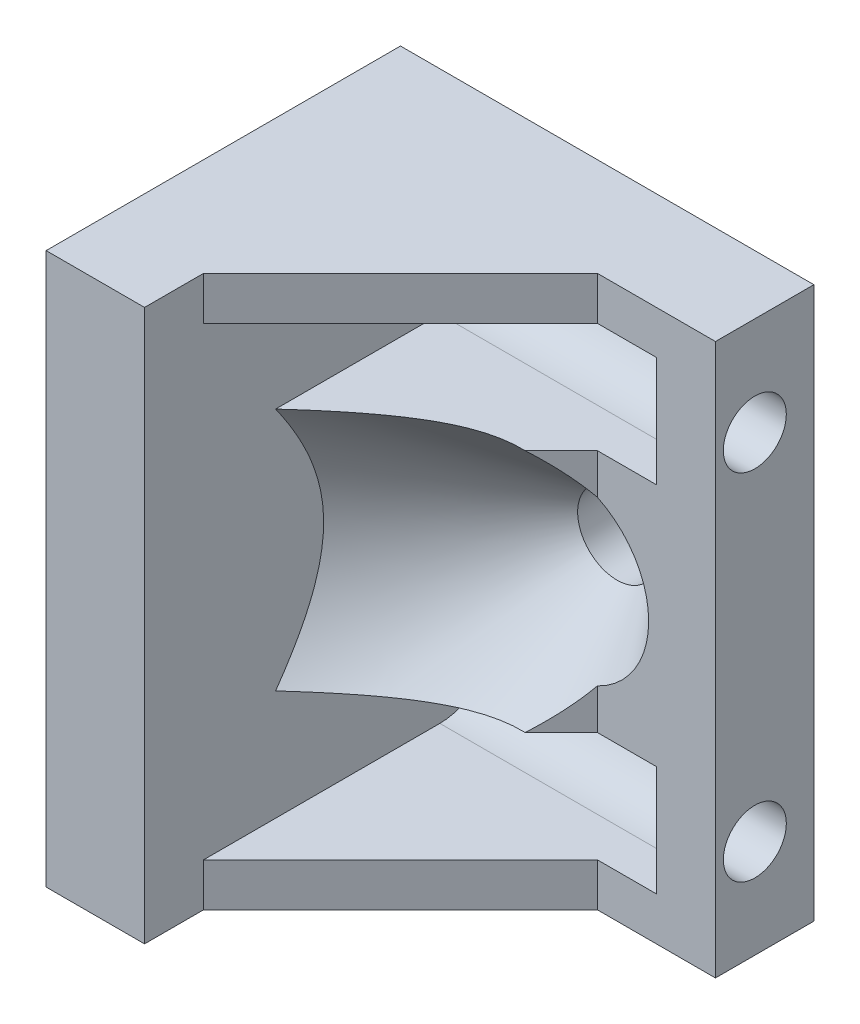
ISO-10303-21;
HEADER;
FILE_DESCRIPTION(('STEP AP214'),'2;1');
FILE_NAME('part.step','',(''),(''),'','','');
FILE_SCHEMA(('AUTOMOTIVE_DESIGN { 1 0 10303 214 1 1 1 1 }'));
ENDSEC;
DATA;
#1=APPLICATION_CONTEXT('core data for automotive mechanical design processes');
#2=APPLICATION_PROTOCOL_DEFINITION('international standard','automotive_design',2000,#1);
#3=PRODUCT_CONTEXT('',#1,'mechanical');
#4=PRODUCT('Part','Part','',(#3));
#5=PRODUCT_RELATED_PRODUCT_CATEGORY('part','',(#4));
#6=PRODUCT_DEFINITION_FORMATION('','',#4);
#7=PRODUCT_DEFINITION_CONTEXT('part definition',#1,'design');
#8=PRODUCT_DEFINITION('design','',#6,#7);
#9=PRODUCT_DEFINITION_SHAPE('','',#8);
#10=(LENGTH_UNIT() NAMED_UNIT(*) SI_UNIT(.MILLI.,.METRE.));
#11=(NAMED_UNIT(*) PLANE_ANGLE_UNIT() SI_UNIT($,.RADIAN.));
#12=(NAMED_UNIT(*) SI_UNIT($,.STERADIAN.) SOLID_ANGLE_UNIT());
#13=UNCERTAINTY_MEASURE_WITH_UNIT(LENGTH_MEASURE(1.E-05),#10,'distance_accuracy_value','');
#14=(GEOMETRIC_REPRESENTATION_CONTEXT(3) GLOBAL_UNCERTAINTY_ASSIGNED_CONTEXT((#13)) GLOBAL_UNIT_ASSIGNED_CONTEXT((#10,
#11,#12)) REPRESENTATION_CONTEXT('',''));
#15=CARTESIAN_POINT('',(0.,0.,0.));
#16=DIRECTION('',(0.,0.,1.));
#17=DIRECTION('',(1.,0.,0.));
#18=AXIS2_PLACEMENT_3D('',#15,#16,#17);
#19=CARTESIAN_POINT('',(2.00000000000018,0.,5.));
#20=DIRECTION('',(-0.707106781186544,0.,-0.707106781186551));
#21=DIRECTION('',(0.,-1.,0.));
#22=AXIS2_PLACEMENT_3D('',#19,#20,#21);
#23=PLANE('',#22);
#24=DIRECTION('',(0.707106781186551,0.,-0.707106781186544));
#25=VECTOR('',#24,1.);
#26=CARTESIAN_POINT('',(6.0000000000001,6.2,1.00000000000012));
#27=LINE('',#26,#25);
#28=CARTESIAN_POINT('',(0.165899815839284,6.2,6.83410018416088));
#29=VERTEX_POINT('',#28);
#30=CARTESIAN_POINT('',(2.00000000000018,6.2,5.));
#31=VERTEX_POINT('',#30);
#32=EDGE_CURVE('E335',#29,#31,#27,.T.);
#33=ORIENTED_EDGE('',*,*,#32,.F.);
#34=CARTESIAN_POINT('',(-22.5786110582015,0.,29.5786110582014));
#35=DIRECTION('',(-0.707106781186544,0.,-0.707106781186551));
#36=DIRECTION('',(-0.707106781186551,0.,0.707106781186544));
#37=AXIS2_PLACEMENT_3D('',#34,#35,#36);
#38=ELLIPSE('',#37,36.7323882776254,12.8390224305274);
#39=CARTESIAN_POINT('',(2.00000000000018,4.15118967847563,5.));
#40=VERTEX_POINT('',#39);
#41=EDGE_CURVE('E329',#40,#29,#38,.F.);
#42=ORIENTED_EDGE('',*,*,#41,.F.);
#43=DIRECTION('',(0.,-1.,0.));
#44=VECTOR('',#43,1.);
#45=CARTESIAN_POINT('',(2.00000000000018,0.,5.));
#46=LINE('',#45,#44);
#47=EDGE_CURVE('E306',#31,#40,#46,.T.);
#48=ORIENTED_EDGE('',*,*,#47,.F.);
#49=EDGE_LOOP('',(#33,#42,#48));
#50=FACE_BOUND('',#49,.T.);
#51=ADVANCED_FACE('F39',(#50),#23,.F.);
#52=CARTESIAN_POINT('',(0.,0.,5.));
#53=DIRECTION('',(0.,0.,1.));
#54=DIRECTION('',(1.,0.,0.));
#55=AXIS2_PLACEMENT_3D('',#52,#53,#54);
#56=PLANE('',#55);
#57=DIRECTION('',(-1.,0.,0.));
#58=VECTOR('',#57,1.);
#59=CARTESIAN_POINT('',(-8.,14.,5.));
#60=LINE('',#59,#58);
#61=CARTESIAN_POINT('',(8.,14.,5.));
#62=VERTEX_POINT('',#61);
#63=CARTESIAN_POINT('',(2.00000000000007,14.,5.));
#64=VERTEX_POINT('',#63);
#65=EDGE_CURVE('E267',#62,#64,#60,.T.);
#66=ORIENTED_EDGE('',*,*,#65,.T.);
#67=DIRECTION('',(0.,-1.,0.));
#68=VECTOR('',#67,1.);
#69=CARTESIAN_POINT('',(2.00000000000007,0.,5.));
#70=LINE('',#69,#68);
#71=CARTESIAN_POINT('',(2.00000000000007,11.8,5.));
#72=VERTEX_POINT('',#71);
#73=EDGE_CURVE('E312',#64,#72,#70,.T.);
#74=ORIENTED_EDGE('',*,*,#73,.T.);
#75=DIRECTION('',(-1.,0.,0.));
#76=VECTOR('',#75,1.);
#77=CARTESIAN_POINT('',(0.,11.8,5.));
#78=LINE('',#77,#76);
#79=CARTESIAN_POINT('',(5.,11.8,5.));
#80=VERTEX_POINT('',#79);
#81=EDGE_CURVE('E230',#80,#72,#78,.T.);
#82=ORIENTED_EDGE('',*,*,#81,.F.);
#83=DIRECTION('',(0.,-1.,0.));
#84=VECTOR('',#83,1.);
#85=CARTESIAN_POINT('',(5.,0.,5.));
#86=LINE('',#85,#84);
#87=CARTESIAN_POINT('',(5.,6.2,5.));
#88=VERTEX_POINT('',#87);
#89=EDGE_CURVE('E290',#80,#88,#86,.T.);
#90=ORIENTED_EDGE('',*,*,#89,.T.);
#91=DIRECTION('',(1.,0.,0.));
#92=VECTOR('',#91,1.);
#93=CARTESIAN_POINT('',(0.,6.2,5.));
#94=LINE('',#93,#92);
#95=EDGE_CURVE('E206',#31,#88,#94,.T.);
#96=ORIENTED_EDGE('',*,*,#95,.F.);
#97=ORIENTED_EDGE('',*,*,#47,.T.);
#98=CARTESIAN_POINT('',(0.,0.,5.));
#99=DIRECTION('',(0.,0.,1.));
#100=DIRECTION('',(1.,0.,0.));
#101=AXIS2_PLACEMENT_3D('',#98,#99,#100);
#102=CIRCLE('',#101,4.60786021344868);
#103=CARTESIAN_POINT('',(2.00000000000018,-4.15118967847563,5.));
#104=VERTEX_POINT('',#103);
#105=EDGE_CURVE('E287',#40,#104,#102,.F.);
#106=ORIENTED_EDGE('',*,*,#105,.T.);
#107=DIRECTION('',(0.,-1.,0.));
#108=VECTOR('',#107,1.);
#109=CARTESIAN_POINT('',(2.00000000000018,0.,5.));
#110=LINE('',#109,#108);
#111=CARTESIAN_POINT('',(2.00000000000018,-6.2,5.));
#112=VERTEX_POINT('',#111);
#113=EDGE_CURVE('E295',#104,#112,#110,.T.);
#114=ORIENTED_EDGE('',*,*,#113,.T.);
#115=DIRECTION('',(-1.,0.,0.));
#116=VECTOR('',#115,1.);
#117=CARTESIAN_POINT('',(0.,-6.2,5.));
#118=LINE('',#117,#116);
#119=CARTESIAN_POINT('',(5.,-6.2,5.));
#120=VERTEX_POINT('',#119);
#121=EDGE_CURVE('E234',#120,#112,#118,.T.);
#122=ORIENTED_EDGE('',*,*,#121,.F.);
#123=DIRECTION('',(0.,-1.,0.));
#124=VECTOR('',#123,1.);
#125=CARTESIAN_POINT('',(5.,0.,5.));
#126=LINE('',#125,#124);
#127=CARTESIAN_POINT('',(5.,-11.8,5.));
#128=VERTEX_POINT('',#127);
#129=EDGE_CURVE('E293',#120,#128,#126,.T.);
#130=ORIENTED_EDGE('',*,*,#129,.T.);
#131=DIRECTION('',(1.,0.,0.));
#132=VECTOR('',#131,1.);
#133=CARTESIAN_POINT('',(0.,-11.8,5.));
#134=LINE('',#133,#132);
#135=CARTESIAN_POINT('',(2.00000000000007,-11.8,5.));
#136=VERTEX_POINT('',#135);
#137=EDGE_CURVE('E196',#136,#128,#134,.T.);
#138=ORIENTED_EDGE('',*,*,#137,.F.);
#139=DIRECTION('',(0.,-1.,0.));
#140=VECTOR('',#139,1.);
#141=CARTESIAN_POINT('',(2.00000000000007,0.,5.));
#142=LINE('',#141,#140);
#143=CARTESIAN_POINT('',(2.00000000000007,-14.,5.));
#144=VERTEX_POINT('',#143);
#145=EDGE_CURVE('E309',#136,#144,#142,.T.);
#146=ORIENTED_EDGE('',*,*,#145,.T.);
#147=DIRECTION('',(1.,0.,0.));
#148=VECTOR('',#147,1.);
#149=CARTESIAN_POINT('',(-8.,-14.,5.));
#150=LINE('',#149,#148);
#151=CARTESIAN_POINT('',(8.,-14.,5.));
#152=VERTEX_POINT('',#151);
#153=EDGE_CURVE('E271',#144,#152,#150,.T.);
#154=ORIENTED_EDGE('',*,*,#153,.T.);
#155=DIRECTION('',(0.,1.,0.));
#156=VECTOR('',#155,1.);
#157=CARTESIAN_POINT('',(8.,14.,5.));
#158=LINE('',#157,#156);
#159=EDGE_CURVE('E264',#152,#62,#158,.T.);
#160=ORIENTED_EDGE('',*,*,#159,.T.);
#161=EDGE_LOOP('',(#66,#74,#82,#90,#96,#97,#106,#114,#122,#130,#138,#146,#154,#160));
#162=FACE_BOUND('',#161,.T.);
#163=ADVANCED_FACE('F384',(#162),#56,.T.);
#164=CARTESIAN_POINT('',(0.,0.,0.));
#165=DIRECTION('',(0.,0.,1.));
#166=DIRECTION('',(1.,0.,0.));
#167=AXIS2_PLACEMENT_3D('',#164,#165,#166);
#168=PLANE('',#167);
#169=DIRECTION('',(0.,1.,0.));
#170=VECTOR('',#169,1.);
#171=CARTESIAN_POINT('',(8.,14.,0.));
#172=LINE('',#171,#170);
#173=CARTESIAN_POINT('',(8.,-14.,0.));
#174=VERTEX_POINT('',#173);
#175=CARTESIAN_POINT('',(8.,14.,0.));
#176=VERTEX_POINT('',#175);
#177=EDGE_CURVE('E263',#174,#176,#172,.T.);
#178=ORIENTED_EDGE('',*,*,#177,.F.);
#179=DIRECTION('',(1.,0.,0.));
#180=VECTOR('',#179,1.);
#181=CARTESIAN_POINT('',(-8.,-14.,0.));
#182=LINE('',#181,#180);
#183=CARTESIAN_POINT('',(-13.,-14.,0.));
#184=VERTEX_POINT('',#183);
#185=EDGE_CURVE('E268',#184,#174,#182,.T.);
#186=ORIENTED_EDGE('',*,*,#185,.F.);
#187=DIRECTION('',(0.,-1.,0.));
#188=VECTOR('',#187,1.);
#189=CARTESIAN_POINT('',(-13.,14.,0.));
#190=LINE('',#189,#188);
#191=CARTESIAN_POINT('',(-13.,14.,0.));
#192=VERTEX_POINT('',#191);
#193=EDGE_CURVE('E241',#192,#184,#190,.T.);
#194=ORIENTED_EDGE('',*,*,#193,.F.);
#195=DIRECTION('',(-1.,0.,0.));
#196=VECTOR('',#195,1.);
#197=CARTESIAN_POINT('',(-8.,14.,0.));
#198=LINE('',#197,#196);
#199=EDGE_CURVE('E276',#176,#192,#198,.T.);
#200=ORIENTED_EDGE('',*,*,#199,.F.);
#201=EDGE_LOOP('',(#178,#186,#194,#200));
#202=FACE_BOUND('',#201,.T.);
#203=CARTESIAN_POINT('',(0.,0.,0.));
#204=DIRECTION('',(0.,0.,1.));
#205=DIRECTION('',(1.,0.,0.));
#206=AXIS2_PLACEMENT_3D('',#203,#204,#205);
#207=CIRCLE('',#206,2.);
#208=CARTESIAN_POINT('',(2.00000000000001,0.,0.));
#209=VERTEX_POINT('',#208);
#210=EDGE_CURVE('E260',#209,#209,#207,.T.);
#211=ORIENTED_EDGE('',*,*,#210,.T.);
#212=EDGE_LOOP('',(#211));
#213=FACE_BOUND('',#212,.T.);
#214=ADVANCED_FACE('F389',(#202,#213),#168,.F.);
#215=CARTESIAN_POINT('',(8.,14.,5.));
#216=DIRECTION('',(-1.,0.,0.));
#217=DIRECTION('',(0.,-1.,0.));
#218=AXIS2_PLACEMENT_3D('',#215,#216,#217);
#219=PLANE('',#218);
#220=CARTESIAN_POINT('',(8.,-9.00000000000001,3.));
#221=DIRECTION('',(1.,0.,0.));
#222=DIRECTION('',(0.,0.,-1.));
#223=AXIS2_PLACEMENT_3D('',#220,#221,#222);
#224=CIRCLE('',#223,1.6);
#225=CARTESIAN_POINT('',(8.,-9.00000000000001,1.4));
#226=VERTEX_POINT('',#225);
#227=EDGE_CURVE('E740',#226,#226,#224,.T.);
#228=ORIENTED_EDGE('',*,*,#227,.F.);
#229=EDGE_LOOP('',(#228));
#230=FACE_BOUND('',#229,.T.);
#231=CARTESIAN_POINT('',(8.,9.,3.));
#232=DIRECTION('',(1.,0.,0.));
#233=DIRECTION('',(0.,0.,-1.));
#234=AXIS2_PLACEMENT_3D('',#231,#232,#233);
#235=CIRCLE('',#234,1.6);
#236=CARTESIAN_POINT('',(8.,9.,1.4));
#237=VERTEX_POINT('',#236);
#238=EDGE_CURVE('E737',#237,#237,#235,.T.);
#239=ORIENTED_EDGE('',*,*,#238,.F.);
#240=EDGE_LOOP('',(#239));
#241=FACE_BOUND('',#240,.T.);
#242=ORIENTED_EDGE('',*,*,#177,.T.);
#243=DIRECTION('',(0.,0.,-1.));
#244=VECTOR('',#243,1.);
#245=CARTESIAN_POINT('',(8.,14.,5.));
#246=LINE('',#245,#244);
#247=EDGE_CURVE('E281',#62,#176,#246,.T.);
#248=ORIENTED_EDGE('',*,*,#247,.F.);
#249=ORIENTED_EDGE('',*,*,#159,.F.);
#250=DIRECTION('',(0.,0.,-1.));
#251=VECTOR('',#250,1.);
#252=CARTESIAN_POINT('',(8.,-14.,5.));
#253=LINE('',#252,#251);
#254=EDGE_CURVE('E273',#152,#174,#253,.T.);
#255=ORIENTED_EDGE('',*,*,#254,.T.);
#256=EDGE_LOOP('',(#242,#248,#249,#255));
#257=FACE_BOUND('',#256,.T.);
#258=ADVANCED_FACE('F423',(#230,#241,#257),#219,.F.);
#259=CARTESIAN_POINT('',(-8.,14.,5.));
#260=DIRECTION('',(0.,-1.,0.));
#261=DIRECTION('',(0.,0.,-1.));
#262=AXIS2_PLACEMENT_3D('',#259,#260,#261);
#263=PLANE('',#262);
#264=ORIENTED_EDGE('',*,*,#199,.T.);
#265=DIRECTION('',(0.,0.,-1.));
#266=VECTOR('',#265,1.);
#267=CARTESIAN_POINT('',(-13.,14.,18.));
#268=LINE('',#267,#266);
#269=CARTESIAN_POINT('',(-13.,14.,18.));
#270=VERTEX_POINT('',#269);
#271=EDGE_CURVE('E238',#270,#192,#268,.T.);
#272=ORIENTED_EDGE('',*,*,#271,.F.);
#273=DIRECTION('',(1.,0.,0.));
#274=VECTOR('',#273,1.);
#275=CARTESIAN_POINT('',(-13.,14.,18.));
#276=LINE('',#275,#274);
#277=CARTESIAN_POINT('',(-8.,14.,18.));
#278=VERTEX_POINT('',#277);
#279=EDGE_CURVE('E249',#270,#278,#276,.T.);
#280=ORIENTED_EDGE('',*,*,#279,.T.);
#281=DIRECTION('',(0.,0.,-1.));
#282=VECTOR('',#281,1.);
#283=CARTESIAN_POINT('',(-8.,14.,18.));
#284=LINE('',#283,#282);
#285=CARTESIAN_POINT('',(-8.,14.,15.));
#286=VERTEX_POINT('',#285);
#287=EDGE_CURVE('E237',#278,#286,#284,.T.);
#288=ORIENTED_EDGE('',*,*,#287,.T.);
#289=DIRECTION('',(0.707106781186551,0.,-0.707106781186544));
#290=VECTOR('',#289,1.);
#291=CARTESIAN_POINT('',(-3.00000000000002,14.,10.));
#292=LINE('',#291,#290);
#293=EDGE_CURVE('E323',#286,#64,#292,.T.);
#294=ORIENTED_EDGE('',*,*,#293,.T.);
#295=ORIENTED_EDGE('',*,*,#65,.F.);
#296=ORIENTED_EDGE('',*,*,#247,.T.);
#297=EDGE_LOOP('',(#264,#272,#280,#288,#294,#295,#296));
#298=FACE_BOUND('',#297,.T.);
#299=ADVANCED_FACE('F417',(#298),#263,.F.);
#300=CARTESIAN_POINT('',(-8.,-14.,5.));
#301=DIRECTION('',(0.,1.,0.));
#302=DIRECTION('',(0.,0.,1.));
#303=AXIS2_PLACEMENT_3D('',#300,#301,#302);
#304=PLANE('',#303);
#305=ORIENTED_EDGE('',*,*,#185,.T.);
#306=ORIENTED_EDGE('',*,*,#254,.F.);
#307=ORIENTED_EDGE('',*,*,#153,.F.);
#308=DIRECTION('',(-0.707106781186551,0.,0.707106781186544));
#309=VECTOR('',#308,1.);
#310=CARTESIAN_POINT('',(-3.00000000000002,-14.,10.));
#311=LINE('',#310,#309);
#312=CARTESIAN_POINT('',(-8.,-14.,15.));
#313=VERTEX_POINT('',#312);
#314=EDGE_CURVE('E325',#144,#313,#311,.T.);
#315=ORIENTED_EDGE('',*,*,#314,.T.);
#316=DIRECTION('',(0.,0.,1.));
#317=VECTOR('',#316,1.);
#318=CARTESIAN_POINT('',(-8.,-14.,0.));
#319=LINE('',#318,#317);
#320=CARTESIAN_POINT('',(-8.,-14.,18.));
#321=VERTEX_POINT('',#320);
#322=EDGE_CURVE('E252',#313,#321,#319,.T.);
#323=ORIENTED_EDGE('',*,*,#322,.T.);
#324=DIRECTION('',(1.,0.,0.));
#325=VECTOR('',#324,1.);
#326=CARTESIAN_POINT('',(-13.,-14.,18.));
#327=LINE('',#326,#325);
#328=CARTESIAN_POINT('',(-13.,-14.,18.));
#329=VERTEX_POINT('',#328);
#330=EDGE_CURVE('E257',#329,#321,#327,.T.);
#331=ORIENTED_EDGE('',*,*,#330,.F.);
#332=DIRECTION('',(0.,0.,1.));
#333=VECTOR('',#332,1.);
#334=CARTESIAN_POINT('',(-13.,-14.,0.));
#335=LINE('',#334,#333);
#336=EDGE_CURVE('E245',#184,#329,#335,.T.);
#337=ORIENTED_EDGE('',*,*,#336,.F.);
#338=EDGE_LOOP('',(#305,#306,#307,#315,#323,#331,#337));
#339=FACE_BOUND('',#338,.T.);
#340=ADVANCED_FACE('F455',(#339),#304,.F.);
#341=CARTESIAN_POINT('',(0.,0.,5.));
#342=DIRECTION('',(0.,0.,-1.));
#343=DIRECTION('',(-1.,0.,0.));
#344=AXIS2_PLACEMENT_3D('',#341,#342,#343);
#345=CYLINDRICAL_SURFACE('',#344,2.);
#346=CARTESIAN_POINT('',(0.,0.,1.99999999999999));
#347=DIRECTION('',(0.,0.,1.));
#348=DIRECTION('',(1.,0.,0.));
#349=AXIS2_PLACEMENT_3D('',#346,#347,#348);
#350=CIRCLE('',#349,2.);
#351=CARTESIAN_POINT('',(2.00000000000001,0.,1.99999999999999));
#352=VERTEX_POINT('',#351);
#353=EDGE_CURVE('E284',#352,#352,#350,.T.);
#354=ORIENTED_EDGE('',*,*,#353,.T.);
#355=EDGE_LOOP('',(#354));
#356=FACE_BOUND('',#355,.T.);
#357=ORIENTED_EDGE('',*,*,#210,.F.);
#358=EDGE_LOOP('',(#357));
#359=FACE_BOUND('',#358,.T.);
#360=ADVANCED_FACE('F450',(#356,#359),#345,.F.);
#361=CARTESIAN_POINT('',(0.,0.,1.99999999999999));
#362=DIRECTION('',(0.,0.,1.));
#363=DIRECTION('',(1.,0.,0.));
#364=AXIS2_PLACEMENT_3D('',#361,#362,#363);
#365=CONICAL_SURFACE('',#364,2.,0.715584993317673);
#366=ORIENTED_EDGE('',*,*,#41,.T.);
#367=CARTESIAN_POINT('',(0.165899815839287,6.2,6.83410018416086));
#368=CARTESIAN_POINT('',(0.0854524939375996,6.2,6.83161960370844));
#369=CARTESIAN_POINT('',(0.0049599534235158,6.2,6.83094810748919));
#370=CARTESIAN_POINT('',(-0.155967024119369,6.2,6.83320421606785));
#371=CARTESIAN_POINT('',(-0.236401466008453,6.2,6.83613147331665));
#372=CARTESIAN_POINT('',(-0.477108803069809,6.2,6.85026442107147));
#373=CARTESIAN_POINT('',(-0.637096589428157,6.2,6.8668119089187));
#374=CARTESIAN_POINT('',(-0.951745062722529,6.2,6.9129027617409));
#375=CARTESIAN_POINT('',(-1.1064473732912,6.2,6.94216903662653));
#376=CARTESIAN_POINT('',(-1.41320836684496,6.2,7.012435004904));
#377=CARTESIAN_POINT('',(-1.56526576052291,6.2,7.05344025952656));
#378=CARTESIAN_POINT('',(-1.95375799605865,6.2,7.17263473399135));
#379=CARTESIAN_POINT('',(-2.18781530629995,6.2,7.25857786607615));
#380=CARTESIAN_POINT('',(-2.64748062600462,6.2,7.45065997838161));
#381=CARTESIAN_POINT('',(-2.87308273052245,6.2,7.556812769256));
#382=CARTESIAN_POINT('',(-3.20813366975678,6.2,7.728954017379));
#383=CARTESIAN_POINT('',(-3.32055521053778,6.2,7.78927259264489));
#384=CARTESIAN_POINT('',(-3.54343572992499,6.2,7.91344317729272));
#385=CARTESIAN_POINT('',(-3.65389467657027,6.2,7.97729524414819));
#386=CARTESIAN_POINT('',(-3.87292665175177,6.2,8.10803920139321));
#387=CARTESIAN_POINT('',(-3.98150047841874,6.2,8.17492975969793));
#388=CARTESIAN_POINT('',(-4.19694252796061,6.2,8.3113863191842));
#389=CARTESIAN_POINT('',(-4.30381082178165,6.2,8.38095220866568));
#390=CARTESIAN_POINT('',(-4.6469764425234,6.2,8.6097538324039));
#391=CARTESIAN_POINT('',(-4.88016821467337,6.2,8.77365737051017));
#392=CARTESIAN_POINT('',(-5.34016608000864,6.2,9.11022742411434));
#393=CARTESIAN_POINT('',(-5.5669704815534,6.2,9.28289622770847));
#394=CARTESIAN_POINT('',(-6.01550059445731,6.2,9.63510203045283));
#395=CARTESIAN_POINT('',(-6.23722145199067,6.2,9.81464518963651));
#396=CARTESIAN_POINT('',(-6.67627489866721,6.2,10.1789582288703));
#397=CARTESIAN_POINT('',(-6.89360788836301,6.2,10.3637276281048));
#398=CARTESIAN_POINT('',(-7.3255666773944,6.2,10.738227432071));
#399=CARTESIAN_POINT('',(-7.54017706397409,6.2,10.9279755699905));
#400=CARTESIAN_POINT('',(-7.96635006586118,6.2,11.3108651911766));
#401=CARTESIAN_POINT('',(-8.17791262231926,6.2,11.5040067398057));
#402=CARTESIAN_POINT('',(-8.59836154332632,6.2,11.8929630409263));
#403=CARTESIAN_POINT('',(-8.80724921938908,6.2,12.0887763778839));
#404=CARTESIAN_POINT('',(-9.22284734602362,6.2,12.4827018020615));
#405=CARTESIAN_POINT('',(-9.42955776958751,6.2,12.6808139177329));
#406=CARTESIAN_POINT('',(-9.9914966403294,6.2,13.2244231959267));
#407=CARTESIAN_POINT('',(-10.3448744972848,6.2,13.5718331315365));
#408=CARTESIAN_POINT('',(-11.0473744196717,6.2,14.2710104152204));
#409=CARTESIAN_POINT('',(-11.3964959055096,6.2,14.6227783438626));
#410=CARTESIAN_POINT('',(-12.0883599349184,6.2,15.3266060450092));
#411=CARTESIAN_POINT('',(-12.4311315147704,6.2,15.6786373178688));
#412=CARTESIAN_POINT('',(-13.1138960269817,6.2,16.3852564200627));
#413=CARTESIAN_POINT('',(-13.45388947518,6.2,16.7398437506686));
#414=CARTESIAN_POINT('',(-13.7928367636548,6.2,17.0954180633267));
#415=B_SPLINE_CURVE_WITH_KNOTS('',3,(#367,#368,#369,#370,#371,#372,#373,#374,#375,#376,#377,
#378,#379,#380,#381,#382,#383,#384,#385,#386,#387,#388,#389,#390,#391,#392,#393,#394,#395,#396,
#397,#398,#399,#400,#401,#402,#403,#404,#405,#406,#407,#408,#409,#410,#411,#412,#413,#414),
.UNSPECIFIED.,.F.,.F.,(4,2,2,2,2,2,2,2,2,2,2,2,2,2,2,2,2,2,2,2,2,2,2,4),(0.,0.241415720809553,
0.482808128760809,0.964663269062492,1.43650931840259,1.90857927130692,2.65529052160058,
3.40251389480891,3.78520504900688,4.1679024296474,4.55043362386823,4.93294886399936,
5.7877345300673,6.64274448956265,7.4985394189486,8.35425586941339,9.2136056607899,
10.0729720228224,10.9318995200261,11.7908376593425,13.2774319088057,14.7642263774724,
16.2382407373458,17.7119748842424),.UNSPECIFIED.);
#416=CARTESIAN_POINT('',(-8.,6.2,11.3424463871447));
#417=VERTEX_POINT('',#416);
#418=EDGE_CURVE('E337',#29,#417,#415,.T.);
#419=ORIENTED_EDGE('',*,*,#418,.T.);
#420=CARTESIAN_POINT('',(-8.,6.2,11.3424463871447));
#421=CARTESIAN_POINT('',(-8.,6.06446138209479,11.246946626476));
#422=CARTESIAN_POINT('',(-8.,5.92800529387916,11.1527335120147));
#423=CARTESIAN_POINT('',(-8.,5.65305399520833,10.9672706326851));
#424=CARTESIAN_POINT('',(-8.,5.51455836097035,10.8760214966767));
#425=CARTESIAN_POINT('',(-8.,5.23484913992488,10.6965761675482));
#426=CARTESIAN_POINT('',(-8.,5.09362721039085,10.6083929256361));
#427=CARTESIAN_POINT('',(-8.,4.80881265785979,10.4359685336822));
#428=CARTESIAN_POINT('',(-8.,4.66522016479935,10.3517271685402));
#429=CARTESIAN_POINT('',(-8.,4.22301559258754,10.1014626473688));
#430=CARTESIAN_POINT('',(-8.,3.92025050214922,9.94264387379291));
#431=CARTESIAN_POINT('',(-8.,3.30296719247313,9.65049661922187));
#432=CARTESIAN_POINT('',(-8.,2.98846768005339,9.51712947872468));
#433=CARTESIAN_POINT('',(-8.,2.46634231722398,9.32712026147012));
#434=CARTESIAN_POINT('',(-8.,2.26239661375858,9.26037740767117));
#435=CARTESIAN_POINT('',(-8.,1.850028195375,9.14229207494978));
#436=CARTESIAN_POINT('',(-8.,1.64160537564422,9.09094995699195));
#437=CARTESIAN_POINT('',(-8.,1.22312439260939,9.00616545355613));
#438=CARTESIAN_POINT('',(-8.,1.01309941114457,8.97256120520363));
#439=CARTESIAN_POINT('',(-8.,0.590881258573948,8.92411643567965));
#440=CARTESIAN_POINT('',(-8.,0.378688254291319,8.90927448160248));
#441=CARTESIAN_POINT('',(-8.,-0.0477178954834537,8.89908380724976));
#442=CARTESIAN_POINT('',(-8.,-0.261934511570398,8.90387760232381));
#443=CARTESIAN_POINT('',(-8.,-0.689016862688569,8.93302362408575));
#444=CARTESIAN_POINT('',(-8.,-0.901882563718296,8.95737634110443));
#445=CARTESIAN_POINT('',(-8.,-1.32545085569344,9.0245323224012));
#446=CARTESIAN_POINT('',(-8.,-1.53614257722871,9.06740328442943));
#447=CARTESIAN_POINT('',(-8.,-1.9534465091492,9.16969155859051));
#448=CARTESIAN_POINT('',(-8.,-2.16005799527765,9.22911178050398));
#449=CARTESIAN_POINT('',(-8.,-2.68413726906162,9.39998035807564));
#450=CARTESIAN_POINT('',(-8.,-2.99820593897757,9.52184663600911));
#451=CARTESIAN_POINT('',(-8.,-3.61446677412625,9.79259172045146));
#452=CARTESIAN_POINT('',(-8.,-3.91664987812359,9.94149066824817));
#453=CARTESIAN_POINT('',(-8.,-4.36319397344508,10.180877383728));
#454=CARTESIAN_POINT('',(-8.,-4.51167970714308,10.2638231941074));
#455=CARTESIAN_POINT('',(-8.,-4.80604361167052,10.434232230757));
#456=CARTESIAN_POINT('',(-8.,-4.95192174668071,10.5216955190174));
#457=CARTESIAN_POINT('',(-8.,-5.24118676236601,10.7004887055818));
#458=CARTESIAN_POINT('',(-8.,-5.38457476298525,10.79181679864));
#459=CARTESIAN_POINT('',(-8.,-5.66911378536614,10.9778713852568));
#460=CARTESIAN_POINT('',(-8.,-5.81026490426118,11.0725977306651));
#461=CARTESIAN_POINT('',(-8.,-6.27815944447799,11.3938161905561));
#462=CARTESIAN_POINT('',(-8.,-6.60036936113751,11.6269255889341));
#463=CARTESIAN_POINT('',(-8.,-7.23582956221234,12.1050987477211));
#464=CARTESIAN_POINT('',(-8.,-7.54907741940416,12.3501656989123));
#465=CARTESIAN_POINT('',(-8.,-8.16855379418064,12.8495605381491));
#466=CARTESIAN_POINT('',(-8.,-8.47477556697284,13.1038967641899));
#467=CARTESIAN_POINT('',(-8.,-9.08122722680408,13.6195295552125));
#468=CARTESIAN_POINT('',(-8.,-9.38145768405376,13.8808254522429));
#469=CARTESIAN_POINT('',(-8.,-9.97827391503686,14.4100275178979));
#470=CARTESIAN_POINT('',(-8.,-10.2748391468716,14.6779567960791));
#471=CARTESIAN_POINT('',(-8.,-10.8638912909483,15.21826420358));
#472=CARTESIAN_POINT('',(-8.,-11.1563781208783,15.49064242245));
#473=CARTESIAN_POINT('',(-8.,-11.7377900934136,16.0388687655915));
#474=CARTESIAN_POINT('',(-8.,-12.026717003806,16.3147150178533));
#475=CARTESIAN_POINT('',(-8.,-12.6016989769424,16.8693867557408));
#476=CARTESIAN_POINT('',(-8.,-12.8877540071786,17.1482122750165));
#477=CARTESIAN_POINT('',(-8.,-13.6811885139944,17.9283371007481));
#478=CARTESIAN_POINT('',(-8.,-14.1859084953586,18.4323410027064));
#479=CARTESIAN_POINT('',(-8.,-15.1895229649515,19.446240270251));
#480=CARTESIAN_POINT('',(-8.,-15.6884166088226,19.9561364689644));
#481=CARTESIAN_POINT('',(-8.,-16.6773708263382,20.9760137784649));
#482=CARTESIAN_POINT('',(-8.,-17.1674704462073,21.4859570620953));
#483=CARTESIAN_POINT('',(-8.,-17.8998754315263,22.2533921971955));
#484=CARTESIAN_POINT('',(-8.,-18.1435297661616,22.5095992334962));
#485=CARTESIAN_POINT('',(-8.,-18.6300270593666,23.0227806184553));
#486=CARTESIAN_POINT('',(-8.,-18.8728700212043,23.2797549640153));
#487=CARTESIAN_POINT('',(-8.,-19.1153520169751,23.5370696014676));
#488=B_SPLINE_CURVE_WITH_KNOTS('',3,(#420,#421,#422,#423,#424,#425,#426,#427,#428,#429,#430,
#431,#432,#433,#434,#435,#436,#437,#438,#439,#440,#441,#442,#443,#444,#445,#446,#447,#448,#449,
#450,#451,#452,#453,#454,#455,#456,#457,#458,#459,#460,#461,#462,#463,#464,#465,#466,#467,#468,
#469,#470,#471,#472,#473,#474,#475,#476,#477,#478,#479,#480,#481,#482,#483,#484,#485,#486,#487),
.UNSPECIFIED.,.F.,.F.,(4,2,2,2,2,2,2,2,2,2,2,2,2,2,2,2,2,2,2,2,2,2,2,2,2,2,2,2,2,2,2,2,2,4),(0.,
0.497416704141716,0.994938263593276,1.49435470509662,1.99374386261289,3.01853524605322,
4.04175742268038,4.68502268132394,5.32830301573147,5.96560707103067,6.60286245148346,
7.24475116676775,7.88665597433086,8.53092754227258,9.17531246112686,10.1841810691177,
11.1938044650379,11.7039874601066,12.2141774579235,12.7241317216686,13.2340637803665,
14.4267121483818,15.6196805248377,16.8137498661883,18.0077050172718,19.2066628014527,
20.4056447486168,21.6040051395734,22.8023790799697,24.94213334697,27.0821939540469,
29.2039992714786,30.2646983487074,31.3253931486029),.UNSPECIFIED.);
#489=CARTESIAN_POINT('',(-8.,-6.20000000000001,11.3424463871447));
#490=VERTEX_POINT('',#489);
#491=EDGE_CURVE('E11',#417,#490,#488,.T.);
#492=ORIENTED_EDGE('',*,*,#491,.T.);
#493=CARTESIAN_POINT('',(0.16589981583928,-6.2,6.83410018416086));
#494=CARTESIAN_POINT('',(0.0854524939375923,-6.2,6.83161960370845));
#495=CARTESIAN_POINT('',(0.00495995342350855,-6.2,6.8309481074892));
#496=CARTESIAN_POINT('',(-0.155967024119376,-6.2,6.83320421606786));
#497=CARTESIAN_POINT('',(-0.23640146600846,-6.2,6.83613147331665));
#498=CARTESIAN_POINT('',(-0.477108803069817,-6.2,6.85026442107148));
#499=CARTESIAN_POINT('',(-0.637096589428165,-6.2,6.86681190891871));
#500=CARTESIAN_POINT('',(-0.951745062722537,-6.2,6.91290276174091));
#501=CARTESIAN_POINT('',(-1.1064473732912,-6.2,6.94216903662653));
#502=CARTESIAN_POINT('',(-1.41320836684497,-6.2,7.01243500490401));
#503=CARTESIAN_POINT('',(-1.56526576052292,-6.2,7.05344025952656));
#504=CARTESIAN_POINT('',(-1.95375799605866,-6.2,7.17263473399136));
#505=CARTESIAN_POINT('',(-2.18781530629996,-6.20000000000001,7.25857786607616));
#506=CARTESIAN_POINT('',(-2.64748062600463,-6.20000000000001,7.45065997838162));
#507=CARTESIAN_POINT('',(-2.87308273052246,-6.20000000000001,7.55681276925601));
#508=CARTESIAN_POINT('',(-3.20813366975679,-6.20000000000001,7.72895401737902));
#509=CARTESIAN_POINT('',(-3.32055521053779,-6.20000000000001,7.78927259264491));
#510=CARTESIAN_POINT('',(-3.54343572992501,-6.20000000000001,7.91344317729274));
#511=CARTESIAN_POINT('',(-3.65389467657029,-6.20000000000001,7.97729524414821));
#512=CARTESIAN_POINT('',(-3.87292665175179,-6.20000000000001,8.10803920139322));
#513=CARTESIAN_POINT('',(-3.98150047841875,-6.20000000000001,8.17492975969795));
#514=CARTESIAN_POINT('',(-4.19694252796062,-6.20000000000001,8.31138631918422));
#515=CARTESIAN_POINT('',(-4.30381082178167,-6.20000000000001,8.38095220866569));
#516=CARTESIAN_POINT('',(-4.64697644252342,-6.20000000000001,8.60975383240391));
#517=CARTESIAN_POINT('',(-4.88016821467339,-6.20000000000001,8.77365737051019));
#518=CARTESIAN_POINT('',(-5.34016608000867,-6.20000000000001,9.11022742411437));
#519=CARTESIAN_POINT('',(-5.56697048155343,-6.20000000000001,9.2828962277085));
#520=CARTESIAN_POINT('',(-6.01550059445735,-6.20000000000001,9.63510203045286));
#521=CARTESIAN_POINT('',(-6.23722145199071,-6.20000000000001,9.81464518963654));
#522=CARTESIAN_POINT('',(-6.67627489866725,-6.20000000000001,10.1789582288703));
#523=CARTESIAN_POINT('',(-6.89360788836305,-6.20000000000001,10.3637276281048));
#524=CARTESIAN_POINT('',(-7.32556667739444,-6.20000000000001,10.738227432071));
#525=CARTESIAN_POINT('',(-7.54017706397414,-6.20000000000001,10.9279755699906));
#526=CARTESIAN_POINT('',(-7.96635006586123,-6.20000000000001,11.3108651911766));
#527=CARTESIAN_POINT('',(-8.17791262231931,-6.20000000000001,11.5040067398057));
#528=CARTESIAN_POINT('',(-8.59836154332638,-6.20000000000001,11.8929630409264));
#529=CARTESIAN_POINT('',(-8.80724921938914,-6.20000000000001,12.088776377884));
#530=CARTESIAN_POINT('',(-9.22284734602368,-6.20000000000001,12.4827018020615));
#531=CARTESIAN_POINT('',(-9.42955776958757,-6.20000000000001,12.680813917733));
#532=CARTESIAN_POINT('',(-9.99149664032948,-6.20000000000001,13.2244231959268));
#533=CARTESIAN_POINT('',(-10.3448744972848,-6.20000000000001,13.5718331315366));
#534=CARTESIAN_POINT('',(-11.0473744196717,-6.20000000000001,14.2710104152205));
#535=CARTESIAN_POINT('',(-11.3964959055097,-6.20000000000001,14.6227783438627));
#536=CARTESIAN_POINT('',(-12.0883599349185,-6.20000000000001,15.3266060450093));
#537=CARTESIAN_POINT('',(-12.4311315147705,-6.20000000000001,15.6786373178689));
#538=CARTESIAN_POINT('',(-13.1138960269818,-6.20000000000001,16.3852564200628));
#539=CARTESIAN_POINT('',(-13.4538894751801,-6.20000000000001,16.7398437506687));
#540=CARTESIAN_POINT('',(-13.7928367636549,-6.20000000000001,17.0954180633268));
#541=B_SPLINE_CURVE_WITH_KNOTS('',3,(#493,#494,#495,#496,#497,#498,#499,#500,#501,#502,#503,
#504,#505,#506,#507,#508,#509,#510,#511,#512,#513,#514,#515,#516,#517,#518,#519,#520,#521,#522,
#523,#524,#525,#526,#527,#528,#529,#530,#531,#532,#533,#534,#535,#536,#537,#538,#539,#540),
.UNSPECIFIED.,.F.,.F.,(4,2,2,2,2,2,2,2,2,2,2,2,2,2,2,2,2,2,2,2,2,2,2,4),(0.,0.241415720809553,
0.482808128760809,0.964663269062493,1.43650931840259,1.90857927130692,2.65529052160058,
3.40251389480892,3.78520504900689,4.16790242964742,4.55043362386825,4.93294886399938,
5.78773453006732,6.64274448956269,7.49853941894864,8.35425586941344,9.21360566078995,
10.0729720228225,10.9318995200262,11.7908376593426,13.2774319088058,14.7642263774725,
16.238240737346,17.7119748842425),.UNSPECIFIED.);
#542=CARTESIAN_POINT('',(0.165899815839276,-6.2,6.83410018416088));
#543=VERTEX_POINT('',#542);
#544=EDGE_CURVE('E52',#543,#490,#541,.T.);
#545=ORIENTED_EDGE('',*,*,#544,.F.);
#546=EDGE_CURVE('E330',#543,#104,#38,.F.);
#547=ORIENTED_EDGE('',*,*,#546,.T.);
#548=ORIENTED_EDGE('',*,*,#105,.F.);
#549=EDGE_LOOP('',(#366,#419,#492,#545,#547,#548));
#550=FACE_BOUND('',#549,.T.);
#551=ORIENTED_EDGE('',*,*,#353,.F.);
#552=EDGE_LOOP('',(#551));
#553=FACE_BOUND('',#552,.T.);
#554=ADVANCED_FACE('F348',(#550,#553),#365,.F.);
#555=CARTESIAN_POINT('',(-13.,-14.,18.));
#556=DIRECTION('',(0.,0.,-1.));
#557=DIRECTION('',(0.,1.,0.));
#558=AXIS2_PLACEMENT_3D('',#555,#556,#557);
#559=PLANE('',#558);
#560=DIRECTION('',(0.,1.,0.));
#561=VECTOR('',#560,1.);
#562=CARTESIAN_POINT('',(-8.,-14.,18.));
#563=LINE('',#562,#561);
#564=EDGE_CURVE('E242',#321,#278,#563,.T.);
#565=ORIENTED_EDGE('',*,*,#564,.T.);
#566=ORIENTED_EDGE('',*,*,#279,.F.);
#567=DIRECTION('',(0.,1.,0.));
#568=VECTOR('',#567,1.);
#569=CARTESIAN_POINT('',(-13.,-14.,18.));
#570=LINE('',#569,#568);
#571=EDGE_CURVE('E247',#329,#270,#570,.T.);
#572=ORIENTED_EDGE('',*,*,#571,.F.);
#573=ORIENTED_EDGE('',*,*,#330,.T.);
#574=EDGE_LOOP('',(#565,#566,#572,#573));
#575=FACE_BOUND('',#574,.T.);
#576=ADVANCED_FACE('F436',(#575),#559,.F.);
#577=CARTESIAN_POINT('',(-13.,0.,0.));
#578=DIRECTION('',(-1.,0.,0.));
#579=DIRECTION('',(0.,0.,1.));
#580=AXIS2_PLACEMENT_3D('',#577,#578,#579);
#581=PLANE('',#580);
#582=CARTESIAN_POINT('',(-13.,-9.00000000000001,3.));
#583=DIRECTION('',(1.,0.,0.));
#584=DIRECTION('',(0.,0.,-1.));
#585=AXIS2_PLACEMENT_3D('',#582,#583,#584);
#586=CIRCLE('',#585,1.6);
#587=CARTESIAN_POINT('',(-13.,-9.00000000000001,1.4));
#588=VERTEX_POINT('',#587);
#589=EDGE_CURVE('E300',#588,#588,#586,.T.);
#590=ORIENTED_EDGE('',*,*,#589,.T.);
#591=EDGE_LOOP('',(#590));
#592=FACE_BOUND('',#591,.T.);
#593=CARTESIAN_POINT('',(-13.,9.,3.));
#594=DIRECTION('',(1.,0.,0.));
#595=DIRECTION('',(0.,0.,-1.));
#596=AXIS2_PLACEMENT_3D('',#593,#594,#595);
#597=CIRCLE('',#596,1.6);
#598=CARTESIAN_POINT('',(-13.,9.,1.4));
#599=VERTEX_POINT('',#598);
#600=EDGE_CURVE('E730',#599,#599,#597,.T.);
#601=ORIENTED_EDGE('',*,*,#600,.T.);
#602=EDGE_LOOP('',(#601));
#603=FACE_BOUND('',#602,.T.);
#604=ORIENTED_EDGE('',*,*,#271,.T.);
#605=ORIENTED_EDGE('',*,*,#193,.T.);
#606=ORIENTED_EDGE('',*,*,#336,.T.);
#607=ORIENTED_EDGE('',*,*,#571,.T.);
#608=EDGE_LOOP('',(#604,#605,#606,#607));
#609=FACE_BOUND('',#608,.T.);
#610=ADVANCED_FACE('F431',(#592,#603,#609),#581,.T.);
#611=CARTESIAN_POINT('',(-8.,0.,0.));
#612=DIRECTION('',(-1.,0.,0.));
#613=DIRECTION('',(0.,0.,1.));
#614=AXIS2_PLACEMENT_3D('',#611,#612,#613);
#615=PLANE('',#614);
#616=ORIENTED_EDGE('',*,*,#491,.F.);
#617=DIRECTION('',(0.,0.,1.));
#618=VECTOR('',#617,1.);
#619=CARTESIAN_POINT('',(-8.,6.2,0.));
#620=LINE('',#619,#618);
#621=CARTESIAN_POINT('',(-8.,6.2,3.));
#622=VERTEX_POINT('',#621);
#623=EDGE_CURVE('E221',#622,#417,#620,.T.);
#624=ORIENTED_EDGE('',*,*,#623,.F.);
#625=CARTESIAN_POINT('',(-8.,9.,3.));
#626=DIRECTION('',(-1.,0.,0.));
#627=DIRECTION('',(0.,-1.,0.));
#628=AXIS2_PLACEMENT_3D('',#625,#626,#627);
#629=CIRCLE('',#628,2.8);
#630=CARTESIAN_POINT('',(-8.,11.8,3.));
#631=VERTEX_POINT('',#630);
#632=EDGE_CURVE('E218',#631,#622,#629,.T.);
#633=ORIENTED_EDGE('',*,*,#632,.F.);
#634=DIRECTION('',(0.,0.,-1.));
#635=VECTOR('',#634,1.);
#636=CARTESIAN_POINT('',(-8.,11.8,0.));
#637=LINE('',#636,#635);
#638=CARTESIAN_POINT('',(-8.,11.8,15.));
#639=VERTEX_POINT('',#638);
#640=EDGE_CURVE('E212',#639,#631,#637,.T.);
#641=ORIENTED_EDGE('',*,*,#640,.F.);
#642=DIRECTION('',(0.,1.,0.));
#643=VECTOR('',#642,1.);
#644=CARTESIAN_POINT('',(-8.,0.,15.));
#645=LINE('',#644,#643);
#646=EDGE_CURVE('E318',#639,#286,#645,.T.);
#647=ORIENTED_EDGE('',*,*,#646,.T.);
#648=ORIENTED_EDGE('',*,*,#287,.F.);
#649=ORIENTED_EDGE('',*,*,#564,.F.);
#650=ORIENTED_EDGE('',*,*,#322,.F.);
#651=DIRECTION('',(0.,1.,0.));
#652=VECTOR('',#651,1.);
#653=CARTESIAN_POINT('',(-8.,0.,15.));
#654=LINE('',#653,#652);
#655=CARTESIAN_POINT('',(-8.,-11.8,15.));
#656=VERTEX_POINT('',#655);
#657=EDGE_CURVE('E315',#313,#656,#654,.T.);
#658=ORIENTED_EDGE('',*,*,#657,.T.);
#659=DIRECTION('',(0.,0.,1.));
#660=VECTOR('',#659,1.);
#661=CARTESIAN_POINT('',(-8.,-11.8,0.));
#662=LINE('',#661,#660);
#663=CARTESIAN_POINT('',(-8.,-11.8,3.));
#664=VERTEX_POINT('',#663);
#665=EDGE_CURVE('E202',#664,#656,#662,.T.);
#666=ORIENTED_EDGE('',*,*,#665,.F.);
#667=CARTESIAN_POINT('',(-8.,-9.00000000000001,3.));
#668=DIRECTION('',(-1.,0.,0.));
#669=DIRECTION('',(0.,-1.,0.));
#670=AXIS2_PLACEMENT_3D('',#667,#668,#669);
#671=CIRCLE('',#670,2.8);
#672=CARTESIAN_POINT('',(-8.,-6.20000000000001,3.));
#673=VERTEX_POINT('',#672);
#674=EDGE_CURVE('E179',#664,#673,#671,.F.);
#675=ORIENTED_EDGE('',*,*,#674,.T.);
#676=DIRECTION('',(0.,0.,-1.));
#677=VECTOR('',#676,1.);
#678=CARTESIAN_POINT('',(-8.,-6.20000000000001,0.));
#679=LINE('',#678,#677);
#680=EDGE_CURVE('E192',#490,#673,#679,.T.);
#681=ORIENTED_EDGE('',*,*,#680,.F.);
#682=EDGE_LOOP('',(#616,#624,#633,#641,#647,#648,#649,#650,#658,#666,#675,#681));
#683=FACE_BOUND('',#682,.T.);
#684=CARTESIAN_POINT('',(-8.,-9.00000000000001,3.));
#685=DIRECTION('',(-1.,0.,0.));
#686=DIRECTION('',(0.,0.,1.));
#687=AXIS2_PLACEMENT_3D('',#684,#685,#686);
#688=CIRCLE('',#687,1.6);
#689=CARTESIAN_POINT('',(-8.,-9.00000000000001,4.6));
#690=VERTEX_POINT('',#689);
#691=EDGE_CURVE('E299',#690,#690,#688,.T.);
#692=ORIENTED_EDGE('',*,*,#691,.T.);
#693=EDGE_LOOP('',(#692));
#694=FACE_BOUND('',#693,.T.);
#695=CARTESIAN_POINT('',(-8.,9.,3.));
#696=DIRECTION('',(-1.,0.,0.));
#697=DIRECTION('',(0.,0.,1.));
#698=AXIS2_PLACEMENT_3D('',#695,#696,#697);
#699=CIRCLE('',#698,1.6);
#700=CARTESIAN_POINT('',(-8.,9.,4.6));
#701=VERTEX_POINT('',#700);
#702=EDGE_CURVE('E222',#701,#701,#699,.T.);
#703=ORIENTED_EDGE('',*,*,#702,.T.);
#704=EDGE_LOOP('',(#703));
#705=FACE_BOUND('',#704,.T.);
#706=ADVANCED_FACE('F411',(#683,#694,#705),#615,.F.);
#707=CARTESIAN_POINT('',(5.,9.,3.));
#708=DIRECTION('',(-1.,0.,0.));
#709=DIRECTION('',(0.,-1.,0.));
#710=AXIS2_PLACEMENT_3D('',#707,#708,#709);
#711=CYLINDRICAL_SURFACE('',#710,2.8);
#712=ORIENTED_EDGE('',*,*,#632,.T.);
#713=DIRECTION('',(-1.,0.,0.));
#714=VECTOR('',#713,1.);
#715=CARTESIAN_POINT('',(5.,6.2,3.));
#716=LINE('',#715,#714);
#717=CARTESIAN_POINT('',(5.,6.2,3.));
#718=VERTEX_POINT('',#717);
#719=EDGE_CURVE('E217',#718,#622,#716,.T.);
#720=ORIENTED_EDGE('',*,*,#719,.F.);
#721=CARTESIAN_POINT('',(5.,9.,3.));
#722=DIRECTION('',(-1.,0.,0.));
#723=DIRECTION('',(0.,-1.,0.));
#724=AXIS2_PLACEMENT_3D('',#721,#722,#723);
#725=CIRCLE('',#724,2.8);
#726=CARTESIAN_POINT('',(5.,11.8,3.));
#727=VERTEX_POINT('',#726);
#728=EDGE_CURVE('E208',#727,#718,#725,.T.);
#729=ORIENTED_EDGE('',*,*,#728,.F.);
#730=DIRECTION('',(-1.,0.,0.));
#731=VECTOR('',#730,1.);
#732=CARTESIAN_POINT('',(5.,11.8,3.));
#733=LINE('',#732,#731);
#734=EDGE_CURVE('E203',#727,#631,#733,.T.);
#735=ORIENTED_EDGE('',*,*,#734,.T.);
#736=EDGE_LOOP('',(#712,#720,#729,#735));
#737=FACE_BOUND('',#736,.T.);
#738=ADVANCED_FACE('F410',(#737),#711,.F.);
#739=CARTESIAN_POINT('',(5.,11.8,0.));
#740=DIRECTION('',(0.,1.,0.));
#741=DIRECTION('',(-1.,0.,0.));
#742=AXIS2_PLACEMENT_3D('',#739,#740,#741);
#743=PLANE('',#742);
#744=ORIENTED_EDGE('',*,*,#81,.T.);
#745=DIRECTION('',(-0.707106781186551,0.,0.707106781186544));
#746=VECTOR('',#745,1.);
#747=CARTESIAN_POINT('',(6.00000000000005,11.8,1.00000000000006));
#748=LINE('',#747,#746);
#749=EDGE_CURVE('E320',#72,#639,#748,.T.);
#750=ORIENTED_EDGE('',*,*,#749,.T.);
#751=ORIENTED_EDGE('',*,*,#640,.T.);
#752=ORIENTED_EDGE('',*,*,#734,.F.);
#753=DIRECTION('',(0.,0.,-1.));
#754=VECTOR('',#753,1.);
#755=CARTESIAN_POINT('',(5.,11.8,0.));
#756=LINE('',#755,#754);
#757=EDGE_CURVE('E215',#80,#727,#756,.T.);
#758=ORIENTED_EDGE('',*,*,#757,.F.);
#759=EDGE_LOOP('',(#744,#750,#751,#752,#758));
#760=FACE_BOUND('',#759,.T.);
#761=ADVANCED_FACE('F406',(#760),#743,.F.);
#762=CARTESIAN_POINT('',(5.,6.2,0.));
#763=DIRECTION('',(0.,-1.,0.));
#764=DIRECTION('',(1.,0.,0.));
#765=AXIS2_PLACEMENT_3D('',#762,#763,#764);
#766=PLANE('',#765);
#767=ORIENTED_EDGE('',*,*,#623,.T.);
#768=ORIENTED_EDGE('',*,*,#418,.F.);
#769=ORIENTED_EDGE('',*,*,#32,.T.);
#770=ORIENTED_EDGE('',*,*,#95,.T.);
#771=DIRECTION('',(0.,0.,1.));
#772=VECTOR('',#771,1.);
#773=CARTESIAN_POINT('',(5.,6.2,0.));
#774=LINE('',#773,#772);
#775=EDGE_CURVE('E211',#718,#88,#774,.T.);
#776=ORIENTED_EDGE('',*,*,#775,.F.);
#777=ORIENTED_EDGE('',*,*,#719,.T.);
#778=EDGE_LOOP('',(#767,#768,#769,#770,#776,#777));
#779=FACE_BOUND('',#778,.T.);
#780=ADVANCED_FACE('F397',(#779),#766,.F.);
#781=CARTESIAN_POINT('',(5.,0.,0.));
#782=DIRECTION('',(-1.,0.,0.));
#783=DIRECTION('',(0.,-1.,0.));
#784=AXIS2_PLACEMENT_3D('',#781,#782,#783);
#785=PLANE('',#784);
#786=CARTESIAN_POINT('',(5.,9.,3.));
#787=DIRECTION('',(-1.,0.,0.));
#788=DIRECTION('',(0.,-1.,0.));
#789=AXIS2_PLACEMENT_3D('',#786,#787,#788);
#790=CIRCLE('',#789,1.6);
#791=CARTESIAN_POINT('',(5.,7.4,3.));
#792=VERTEX_POINT('',#791);
#793=EDGE_CURVE('E301',#792,#792,#790,.T.);
#794=ORIENTED_EDGE('',*,*,#793,.F.);
#795=EDGE_LOOP('',(#794));
#796=FACE_BOUND('',#795,.T.);
#797=ORIENTED_EDGE('',*,*,#757,.T.);
#798=ORIENTED_EDGE('',*,*,#728,.T.);
#799=ORIENTED_EDGE('',*,*,#775,.T.);
#800=ORIENTED_EDGE('',*,*,#89,.F.);
#801=EDGE_LOOP('',(#797,#798,#799,#800));
#802=FACE_BOUND('',#801,.T.);
#803=ADVANCED_FACE('F403',(#796,#802),#785,.T.);
#804=CARTESIAN_POINT('',(5.,-9.00000000000001,3.));
#805=DIRECTION('',(-1.,0.,0.));
#806=DIRECTION('',(0.,-1.,0.));
#807=AXIS2_PLACEMENT_3D('',#804,#805,#806);
#808=CYLINDRICAL_SURFACE('',#807,2.8);
#809=ORIENTED_EDGE('',*,*,#674,.F.);
#810=DIRECTION('',(-1.,0.,0.));
#811=VECTOR('',#810,1.);
#812=CARTESIAN_POINT('',(5.,-11.8,3.));
#813=LINE('',#812,#811);
#814=CARTESIAN_POINT('',(5.,-11.8,3.));
#815=VERTEX_POINT('',#814);
#816=EDGE_CURVE('E172',#815,#664,#813,.T.);
#817=ORIENTED_EDGE('',*,*,#816,.F.);
#818=CARTESIAN_POINT('',(5.,-9.00000000000001,3.));
#819=DIRECTION('',(-1.,0.,0.));
#820=DIRECTION('',(0.,-1.,0.));
#821=AXIS2_PLACEMENT_3D('',#818,#819,#820);
#822=CIRCLE('',#821,2.8);
#823=CARTESIAN_POINT('',(5.,-6.2,3.));
#824=VERTEX_POINT('',#823);
#825=EDGE_CURVE('E176',#815,#824,#822,.F.);
#826=ORIENTED_EDGE('',*,*,#825,.T.);
#827=DIRECTION('',(-1.,0.,0.));
#828=VECTOR('',#827,1.);
#829=CARTESIAN_POINT('',(5.,-6.2,3.));
#830=LINE('',#829,#828);
#831=EDGE_CURVE('E183',#824,#673,#830,.T.);
#832=ORIENTED_EDGE('',*,*,#831,.T.);
#833=EDGE_LOOP('',(#809,#817,#826,#832));
#834=FACE_BOUND('',#833,.T.);
#835=ADVANCED_FACE('F174',(#834),#808,.F.);
#836=CARTESIAN_POINT('',(5.,-6.2,0.));
#837=DIRECTION('',(0.,1.,0.));
#838=DIRECTION('',(-1.,0.,0.));
#839=AXIS2_PLACEMENT_3D('',#836,#837,#838);
#840=PLANE('',#839);
#841=DIRECTION('',(-0.707106781186551,0.,0.707106781186544));
#842=VECTOR('',#841,1.);
#843=CARTESIAN_POINT('',(6.00000000000011,-6.2,1.00000000000011));
#844=LINE('',#843,#842);
#845=EDGE_CURVE('E332',#112,#543,#844,.T.);
#846=ORIENTED_EDGE('',*,*,#845,.T.);
#847=ORIENTED_EDGE('',*,*,#544,.T.);
#848=ORIENTED_EDGE('',*,*,#680,.T.);
#849=ORIENTED_EDGE('',*,*,#831,.F.);
#850=DIRECTION('',(0.,0.,-1.));
#851=VECTOR('',#850,1.);
#852=CARTESIAN_POINT('',(5.,-6.2,0.));
#853=LINE('',#852,#851);
#854=EDGE_CURVE('E184',#120,#824,#853,.T.);
#855=ORIENTED_EDGE('',*,*,#854,.F.);
#856=ORIENTED_EDGE('',*,*,#121,.T.);
#857=EDGE_LOOP('',(#846,#847,#848,#849,#855,#856));
#858=FACE_BOUND('',#857,.T.);
#859=ADVANCED_FACE('F445',(#858),#840,.F.);
#860=CARTESIAN_POINT('',(5.,-11.8,0.));
#861=DIRECTION('',(0.,-1.,0.));
#862=DIRECTION('',(1.,0.,0.));
#863=AXIS2_PLACEMENT_3D('',#860,#861,#862);
#864=PLANE('',#863);
#865=ORIENTED_EDGE('',*,*,#665,.T.);
#866=DIRECTION('',(0.707106781186551,0.,-0.707106781186544));
#867=VECTOR('',#866,1.);
#868=CARTESIAN_POINT('',(6.00000000000005,-11.8,1.00000000000006));
#869=LINE('',#868,#867);
#870=EDGE_CURVE('E327',#656,#136,#869,.T.);
#871=ORIENTED_EDGE('',*,*,#870,.T.);
#872=ORIENTED_EDGE('',*,*,#137,.T.);
#873=DIRECTION('',(0.,0.,1.));
#874=VECTOR('',#873,1.);
#875=CARTESIAN_POINT('',(5.,-11.8,0.));
#876=LINE('',#875,#874);
#877=EDGE_CURVE('E189',#815,#128,#876,.T.);
#878=ORIENTED_EDGE('',*,*,#877,.F.);
#879=ORIENTED_EDGE('',*,*,#816,.T.);
#880=EDGE_LOOP('',(#865,#871,#872,#878,#879));
#881=FACE_BOUND('',#880,.T.);
#882=ADVANCED_FACE('F194',(#881),#864,.F.);
#883=CARTESIAN_POINT('',(5.,0.,0.));
#884=DIRECTION('',(-1.,0.,0.));
#885=DIRECTION('',(0.,-1.,0.));
#886=AXIS2_PLACEMENT_3D('',#883,#884,#885);
#887=PLANE('',#886);
#888=CARTESIAN_POINT('',(5.,-9.00000000000001,3.));
#889=DIRECTION('',(-1.,0.,0.));
#890=DIRECTION('',(0.,-1.,0.));
#891=AXIS2_PLACEMENT_3D('',#888,#889,#890);
#892=CIRCLE('',#891,1.6);
#893=CARTESIAN_POINT('',(5.,-10.6,3.));
#894=VERTEX_POINT('',#893);
#895=EDGE_CURVE('E296',#894,#894,#892,.T.);
#896=ORIENTED_EDGE('',*,*,#895,.F.);
#897=EDGE_LOOP('',(#896));
#898=FACE_BOUND('',#897,.T.);
#899=ORIENTED_EDGE('',*,*,#854,.T.);
#900=ORIENTED_EDGE('',*,*,#825,.F.);
#901=ORIENTED_EDGE('',*,*,#877,.T.);
#902=ORIENTED_EDGE('',*,*,#129,.F.);
#903=EDGE_LOOP('',(#899,#900,#901,#902));
#904=FACE_BOUND('',#903,.T.);
#905=ADVANCED_FACE('F188',(#898,#904),#887,.T.);
#906=CARTESIAN_POINT('',(-13.,-9.00000000000001,3.));
#907=DIRECTION('',(1.,0.,0.));
#908=DIRECTION('',(0.,0.,-1.));
#909=AXIS2_PLACEMENT_3D('',#906,#907,#908);
#910=CYLINDRICAL_SURFACE('',#909,1.6);
#911=ORIENTED_EDGE('',*,*,#895,.T.);
#912=EDGE_LOOP('',(#911));
#913=FACE_BOUND('',#912,.T.);
#914=ORIENTED_EDGE('',*,*,#227,.T.);
#915=EDGE_LOOP('',(#914));
#916=FACE_BOUND('',#915,.T.);
#917=ADVANCED_FACE('F381',(#913,#916),#910,.F.);
#918=CARTESIAN_POINT('',(-13.,9.,3.));
#919=DIRECTION('',(1.,0.,0.));
#920=DIRECTION('',(0.,0.,-1.));
#921=AXIS2_PLACEMENT_3D('',#918,#919,#920);
#922=CYLINDRICAL_SURFACE('',#921,1.6);
#923=ORIENTED_EDGE('',*,*,#793,.T.);
#924=EDGE_LOOP('',(#923));
#925=FACE_BOUND('',#924,.T.);
#926=ORIENTED_EDGE('',*,*,#238,.T.);
#927=EDGE_LOOP('',(#926));
#928=FACE_BOUND('',#927,.T.);
#929=ADVANCED_FACE('F560',(#925,#928),#922,.F.);
#930=ORIENTED_EDGE('',*,*,#600,.F.);
#931=EDGE_LOOP('',(#930));
#932=FACE_BOUND('',#931,.T.);
#933=ORIENTED_EDGE('',*,*,#702,.F.);
#934=EDGE_LOOP('',(#933));
#935=FACE_BOUND('',#934,.T.);
#936=ADVANCED_FACE('F378',(#932,#935),#922,.F.);
#937=ORIENTED_EDGE('',*,*,#589,.F.);
#938=EDGE_LOOP('',(#937));
#939=FACE_BOUND('',#938,.T.);
#940=ORIENTED_EDGE('',*,*,#691,.F.);
#941=EDGE_LOOP('',(#940));
#942=FACE_BOUND('',#941,.T.);
#943=ADVANCED_FACE('F373',(#939,#942),#910,.F.);
#944=CARTESIAN_POINT('',(2.00000000000007,0.,5.));
#945=DIRECTION('',(-0.707106781186544,0.,-0.707106781186551));
#946=DIRECTION('',(0.,-1.,0.));
#947=AXIS2_PLACEMENT_3D('',#944,#945,#946);
#948=PLANE('',#947);
#949=ORIENTED_EDGE('',*,*,#293,.F.);
#950=ORIENTED_EDGE('',*,*,#646,.F.);
#951=ORIENTED_EDGE('',*,*,#749,.F.);
#952=ORIENTED_EDGE('',*,*,#73,.F.);
#953=EDGE_LOOP('',(#949,#950,#951,#952));
#954=FACE_BOUND('',#953,.T.);
#955=ADVANCED_FACE('F368',(#954),#948,.F.);
#956=CARTESIAN_POINT('',(2.00000000000007,0.,5.));
#957=DIRECTION('',(-0.707106781186544,0.,-0.707106781186551));
#958=DIRECTION('',(0.,-1.,0.));
#959=AXIS2_PLACEMENT_3D('',#956,#957,#958);
#960=PLANE('',#959);
#961=ORIENTED_EDGE('',*,*,#870,.F.);
#962=ORIENTED_EDGE('',*,*,#657,.F.);
#963=ORIENTED_EDGE('',*,*,#314,.F.);
#964=ORIENTED_EDGE('',*,*,#145,.F.);
#965=EDGE_LOOP('',(#961,#962,#963,#964));
#966=FACE_BOUND('',#965,.T.);
#967=ADVANCED_FACE('F362',(#966),#960,.F.);
#968=ORIENTED_EDGE('',*,*,#546,.F.);
#969=ORIENTED_EDGE('',*,*,#845,.F.);
#970=ORIENTED_EDGE('',*,*,#113,.F.);
#971=EDGE_LOOP('',(#968,#969,#970));
#972=FACE_BOUND('',#971,.T.);
#973=ADVANCED_FACE('F355',(#972),#23,.F.);
#974=CLOSED_SHELL('',(#51,#163,#214,#258,#299,#340,#360,#554,#576,#610,#706,#738,#761,#780,#803,
#835,#859,#882,#905,#917,#929,#936,#943,#955,#967,#973));
#975=MANIFOLD_SOLID_BREP('B2',#974);
#976=ADVANCED_BREP_SHAPE_REPRESENTATION('',(#18,#975),#14);
#977=SHAPE_DEFINITION_REPRESENTATION(#9,#976);
ENDSEC;
END-ISO-10303-21;
